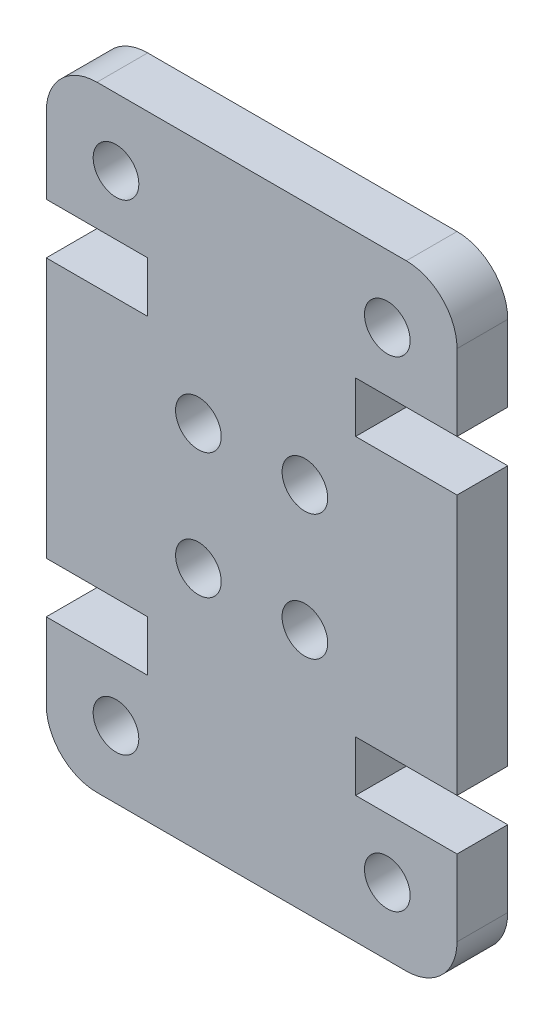
ISO-10303-21;
HEADER;
FILE_DESCRIPTION(('STEP AP214'),'2;1');
FILE_NAME('part.step','',(''),(''),'','','');
FILE_SCHEMA(('AUTOMOTIVE_DESIGN { 1 0 10303 214 1 1 1 1 }'));
ENDSEC;
DATA;
#1=APPLICATION_CONTEXT('core data for automotive mechanical design processes');
#2=APPLICATION_PROTOCOL_DEFINITION('international standard','automotive_design',2000,#1);
#3=PRODUCT_CONTEXT('',#1,'mechanical');
#4=PRODUCT('Part','Part','',(#3));
#5=PRODUCT_RELATED_PRODUCT_CATEGORY('part','',(#4));
#6=PRODUCT_DEFINITION_FORMATION('','',#4);
#7=PRODUCT_DEFINITION_CONTEXT('part definition',#1,'design');
#8=PRODUCT_DEFINITION('design','',#6,#7);
#9=PRODUCT_DEFINITION_SHAPE('','',#8);
#10=(LENGTH_UNIT() NAMED_UNIT(*) SI_UNIT(.MILLI.,.METRE.));
#11=(NAMED_UNIT(*) PLANE_ANGLE_UNIT() SI_UNIT($,.RADIAN.));
#12=(NAMED_UNIT(*) SI_UNIT($,.STERADIAN.) SOLID_ANGLE_UNIT());
#13=UNCERTAINTY_MEASURE_WITH_UNIT(LENGTH_MEASURE(1.E-05),#10,'distance_accuracy_value','');
#14=(GEOMETRIC_REPRESENTATION_CONTEXT(3) GLOBAL_UNCERTAINTY_ASSIGNED_CONTEXT((#13)) GLOBAL_UNIT_ASSIGNED_CONTEXT((#10,
#11,#12)) REPRESENTATION_CONTEXT('',''));
#15=CARTESIAN_POINT('',(0.,0.,0.));
#16=DIRECTION('',(0.,0.,1.));
#17=DIRECTION('',(1.,0.,0.));
#18=AXIS2_PLACEMENT_3D('',#15,#16,#17);
#19=CARTESIAN_POINT('',(14.2,2.,2.));
#20=DIRECTION('',(0.,0.,-1.));
#21=DIRECTION('',(-1.,0.,0.));
#22=AXIS2_PLACEMENT_3D('',#19,#20,#21);
#23=PLANE('',#22);
#24=CARTESIAN_POINT('',(6.00000000000001,9.65355116894447,2.));
#25=DIRECTION('',(0.,0.,1.));
#26=DIRECTION('',(1.,0.,0.));
#27=AXIS2_PLACEMENT_3D('',#24,#25,#26);
#28=CIRCLE('',#27,0.899999999999999);
#29=CARTESIAN_POINT('',(6.9,9.65355116894447,2.));
#30=VERTEX_POINT('',#29);
#31=EDGE_CURVE('E464',#30,#30,#28,.T.);
#32=ORIENTED_EDGE('',*,*,#31,.F.);
#33=EDGE_LOOP('',(#32));
#34=FACE_BOUND('',#33,.T.);
#35=CARTESIAN_POINT('',(10.2,14.6064488310555,2.));
#36=DIRECTION('',(0.,0.,1.));
#37=DIRECTION('',(1.,0.,0.));
#38=AXIS2_PLACEMENT_3D('',#35,#36,#37);
#39=CIRCLE('',#38,0.9);
#40=CARTESIAN_POINT('',(11.1,14.6064488310555,2.));
#41=VERTEX_POINT('',#40);
#42=EDGE_CURVE('E476',#41,#41,#39,.T.);
#43=ORIENTED_EDGE('',*,*,#42,.F.);
#44=EDGE_LOOP('',(#43));
#45=FACE_BOUND('',#44,.T.);
#46=CARTESIAN_POINT('',(2.75000000000003,21.606448831055,2.));
#47=DIRECTION('',(0.,0.,1.));
#48=DIRECTION('',(-1.,0.,0.));
#49=AXIS2_PLACEMENT_3D('',#46,#47,#48);
#50=CIRCLE('',#49,0.9);
#51=CARTESIAN_POINT('',(1.85000000000003,21.606448831055,2.));
#52=VERTEX_POINT('',#51);
#53=EDGE_CURVE('E488',#52,#52,#50,.T.);
#54=ORIENTED_EDGE('',*,*,#53,.F.);
#55=EDGE_LOOP('',(#54));
#56=FACE_BOUND('',#55,.T.);
#57=CARTESIAN_POINT('',(13.45,2.65355116894501,2.));
#58=DIRECTION('',(0.,0.,1.));
#59=DIRECTION('',(-1.,0.,0.));
#60=AXIS2_PLACEMENT_3D('',#57,#58,#59);
#61=CIRCLE('',#60,0.9);
#62=CARTESIAN_POINT('',(12.55,2.65355116894501,2.));
#63=VERTEX_POINT('',#62);
#64=EDGE_CURVE('E230',#63,#63,#61,.T.);
#65=ORIENTED_EDGE('',*,*,#64,.F.);
#66=EDGE_LOOP('',(#65));
#67=FACE_BOUND('',#66,.T.);
#68=CARTESIAN_POINT('',(14.2,2.,2.));
#69=DIRECTION('',(0.,0.,1.));
#70=DIRECTION('',(-1.,0.,0.));
#71=AXIS2_PLACEMENT_3D('',#68,#69,#70);
#72=CIRCLE('',#71,2.);
#73=CARTESIAN_POINT('',(14.2,0.,2.));
#74=VERTEX_POINT('',#73);
#75=CARTESIAN_POINT('',(16.2,2.,2.));
#76=VERTEX_POINT('',#75);
#77=EDGE_CURVE('E273',#74,#76,#72,.T.);
#78=ORIENTED_EDGE('',*,*,#77,.T.);
#79=DIRECTION('',(0.,1.,0.));
#80=VECTOR('',#79,1.);
#81=CARTESIAN_POINT('',(16.2,2.,2.));
#82=LINE('',#81,#80);
#83=CARTESIAN_POINT('',(16.2,4.99999999999945,2.));
#84=VERTEX_POINT('',#83);
#85=EDGE_CURVE('E141',#76,#84,#82,.T.);
#86=ORIENTED_EDGE('',*,*,#85,.T.);
#87=DIRECTION('',(-1.,0.,0.));
#88=VECTOR('',#87,1.);
#89=CARTESIAN_POINT('',(12.2,4.99999999999945,2.));
#90=LINE('',#89,#88);
#91=CARTESIAN_POINT('',(12.2,4.99999999999945,2.));
#92=VERTEX_POINT('',#91);
#93=EDGE_CURVE('E336',#84,#92,#90,.T.);
#94=ORIENTED_EDGE('',*,*,#93,.T.);
#95=DIRECTION('',(0.,1.,0.));
#96=VECTOR('',#95,1.);
#97=CARTESIAN_POINT('',(12.2,6.99999999999945,2.));
#98=LINE('',#97,#96);
#99=CARTESIAN_POINT('',(12.2,6.99999999999945,2.));
#100=VERTEX_POINT('',#99);
#101=EDGE_CURVE('E355',#92,#100,#98,.T.);
#102=ORIENTED_EDGE('',*,*,#101,.T.);
#103=DIRECTION('',(1.,0.,0.));
#104=VECTOR('',#103,1.);
#105=CARTESIAN_POINT('',(16.2,6.99999999999945,2.));
#106=LINE('',#105,#104);
#107=CARTESIAN_POINT('',(16.2,6.99999999999945,2.));
#108=VERTEX_POINT('',#107);
#109=EDGE_CURVE('E352',#100,#108,#106,.T.);
#110=ORIENTED_EDGE('',*,*,#109,.T.);
#111=DIRECTION('',(0.,1.,0.));
#112=VECTOR('',#111,1.);
#113=CARTESIAN_POINT('',(16.2,17.2600000000005,2.));
#114=LINE('',#113,#112);
#115=CARTESIAN_POINT('',(16.2,17.2600000000005,2.));
#116=VERTEX_POINT('',#115);
#117=EDGE_CURVE('E354',#108,#116,#114,.T.);
#118=ORIENTED_EDGE('',*,*,#117,.T.);
#119=DIRECTION('',(-1.,0.,0.));
#120=VECTOR('',#119,1.);
#121=CARTESIAN_POINT('',(16.2,17.2600000000005,2.));
#122=LINE('',#121,#120);
#123=CARTESIAN_POINT('',(12.2,17.2600000000005,2.));
#124=VERTEX_POINT('',#123);
#125=EDGE_CURVE('E357',#116,#124,#122,.T.);
#126=ORIENTED_EDGE('',*,*,#125,.T.);
#127=DIRECTION('',(0.,1.,0.));
#128=VECTOR('',#127,1.);
#129=CARTESIAN_POINT('',(12.2,17.2600000000005,2.));
#130=LINE('',#129,#128);
#131=CARTESIAN_POINT('',(12.2,19.2600000000005,2.));
#132=VERTEX_POINT('',#131);
#133=EDGE_CURVE('E363',#124,#132,#130,.T.);
#134=ORIENTED_EDGE('',*,*,#133,.T.);
#135=DIRECTION('',(1.,0.,0.));
#136=VECTOR('',#135,1.);
#137=CARTESIAN_POINT('',(12.2,19.2600000000005,2.));
#138=LINE('',#137,#136);
#139=CARTESIAN_POINT('',(16.2,19.2600000000005,2.));
#140=VERTEX_POINT('',#139);
#141=EDGE_CURVE('E365',#132,#140,#138,.T.);
#142=ORIENTED_EDGE('',*,*,#141,.T.);
#143=DIRECTION('',(0.,1.,0.));
#144=VECTOR('',#143,1.);
#145=CARTESIAN_POINT('',(16.2,22.26,2.));
#146=LINE('',#145,#144);
#147=CARTESIAN_POINT('',(16.2,22.26,2.));
#148=VERTEX_POINT('',#147);
#149=EDGE_CURVE('E367',#140,#148,#146,.T.);
#150=ORIENTED_EDGE('',*,*,#149,.T.);
#151=CARTESIAN_POINT('',(14.2,22.26,2.));
#152=DIRECTION('',(0.,0.,1.));
#153=DIRECTION('',(1.,0.,0.));
#154=AXIS2_PLACEMENT_3D('',#151,#152,#153);
#155=CIRCLE('',#154,2.);
#156=CARTESIAN_POINT('',(14.2,24.26,2.));
#157=VERTEX_POINT('',#156);
#158=EDGE_CURVE('E369',#148,#157,#155,.T.);
#159=ORIENTED_EDGE('',*,*,#158,.T.);
#160=DIRECTION('',(-1.,0.,0.));
#161=VECTOR('',#160,1.);
#162=CARTESIAN_POINT('',(1.99999999999999,24.26,2.));
#163=LINE('',#162,#161);
#164=CARTESIAN_POINT('',(1.99999999999999,24.26,2.));
#165=VERTEX_POINT('',#164);
#166=EDGE_CURVE('E371',#157,#165,#163,.T.);
#167=ORIENTED_EDGE('',*,*,#166,.T.);
#168=CARTESIAN_POINT('',(2.,22.26,2.));
#169=DIRECTION('',(0.,0.,1.));
#170=DIRECTION('',(-1.,0.,0.));
#171=AXIS2_PLACEMENT_3D('',#168,#169,#170);
#172=CIRCLE('',#171,2.);
#173=CARTESIAN_POINT('',(0.,22.26,2.));
#174=VERTEX_POINT('',#173);
#175=EDGE_CURVE('E373',#165,#174,#172,.T.);
#176=ORIENTED_EDGE('',*,*,#175,.T.);
#177=DIRECTION('',(0.,-1.,0.));
#178=VECTOR('',#177,1.);
#179=CARTESIAN_POINT('',(0.,22.26,2.));
#180=LINE('',#179,#178);
#181=CARTESIAN_POINT('',(0.,19.2600000000005,2.));
#182=VERTEX_POINT('',#181);
#183=EDGE_CURVE('E375',#174,#182,#180,.T.);
#184=ORIENTED_EDGE('',*,*,#183,.T.);
#185=DIRECTION('',(1.,0.,0.));
#186=VECTOR('',#185,1.);
#187=CARTESIAN_POINT('',(3.99999999999999,19.2600000000005,2.));
#188=LINE('',#187,#186);
#189=CARTESIAN_POINT('',(3.99999999999999,19.2600000000005,2.));
#190=VERTEX_POINT('',#189);
#191=EDGE_CURVE('E377',#182,#190,#188,.T.);
#192=ORIENTED_EDGE('',*,*,#191,.T.);
#193=DIRECTION('',(0.,-1.,0.));
#194=VECTOR('',#193,1.);
#195=CARTESIAN_POINT('',(3.99999999999999,17.2600000000005,2.));
#196=LINE('',#195,#194);
#197=CARTESIAN_POINT('',(3.99999999999999,17.2600000000005,2.));
#198=VERTEX_POINT('',#197);
#199=EDGE_CURVE('E379',#190,#198,#196,.T.);
#200=ORIENTED_EDGE('',*,*,#199,.T.);
#201=DIRECTION('',(-1.,0.,0.));
#202=VECTOR('',#201,1.);
#203=CARTESIAN_POINT('',(0.,17.2600000000005,2.));
#204=LINE('',#203,#202);
#205=CARTESIAN_POINT('',(0.,17.2600000000005,2.));
#206=VERTEX_POINT('',#205);
#207=EDGE_CURVE('E381',#198,#206,#204,.T.);
#208=ORIENTED_EDGE('',*,*,#207,.T.);
#209=DIRECTION('',(0.,-1.,0.));
#210=VECTOR('',#209,1.);
#211=CARTESIAN_POINT('',(0.,17.2600000000005,2.));
#212=LINE('',#211,#210);
#213=CARTESIAN_POINT('',(0.,6.99999999999945,2.));
#214=VERTEX_POINT('',#213);
#215=EDGE_CURVE('E383',#206,#214,#212,.T.);
#216=ORIENTED_EDGE('',*,*,#215,.T.);
#217=DIRECTION('',(1.,0.,0.));
#218=VECTOR('',#217,1.);
#219=CARTESIAN_POINT('',(0.,6.99999999999945,2.));
#220=LINE('',#219,#218);
#221=CARTESIAN_POINT('',(4.,6.99999999999945,2.));
#222=VERTEX_POINT('',#221);
#223=EDGE_CURVE('E385',#214,#222,#220,.T.);
#224=ORIENTED_EDGE('',*,*,#223,.T.);
#225=DIRECTION('',(0.,-1.,0.));
#226=VECTOR('',#225,1.);
#227=CARTESIAN_POINT('',(4.,6.99999999999945,2.));
#228=LINE('',#227,#226);
#229=CARTESIAN_POINT('',(4.,4.99999999999945,2.));
#230=VERTEX_POINT('',#229);
#231=EDGE_CURVE('E387',#222,#230,#228,.T.);
#232=ORIENTED_EDGE('',*,*,#231,.T.);
#233=DIRECTION('',(-1.,0.,0.));
#234=VECTOR('',#233,1.);
#235=CARTESIAN_POINT('',(4.,4.99999999999945,2.));
#236=LINE('',#235,#234);
#237=CARTESIAN_POINT('',(0.,4.99999999999945,2.));
#238=VERTEX_POINT('',#237);
#239=EDGE_CURVE('E208',#230,#238,#236,.T.);
#240=ORIENTED_EDGE('',*,*,#239,.T.);
#241=DIRECTION('',(0.,-1.,0.));
#242=VECTOR('',#241,1.);
#243=CARTESIAN_POINT('',(0.,2.,2.));
#244=LINE('',#243,#242);
#245=CARTESIAN_POINT('',(0.,2.,2.));
#246=VERTEX_POINT('',#245);
#247=EDGE_CURVE('E202',#238,#246,#244,.T.);
#248=ORIENTED_EDGE('',*,*,#247,.T.);
#249=CARTESIAN_POINT('',(2.,2.,2.));
#250=DIRECTION('',(0.,0.,1.));
#251=DIRECTION('',(1.,0.,0.));
#252=AXIS2_PLACEMENT_3D('',#249,#250,#251);
#253=CIRCLE('',#252,2.);
#254=CARTESIAN_POINT('',(2.,0.,2.));
#255=VERTEX_POINT('',#254);
#256=EDGE_CURVE('E206',#246,#255,#253,.T.);
#257=ORIENTED_EDGE('',*,*,#256,.T.);
#258=DIRECTION('',(1.,0.,0.));
#259=VECTOR('',#258,1.);
#260=CARTESIAN_POINT('',(2.,0.,2.));
#261=LINE('',#260,#259);
#262=EDGE_CURVE('E50',#255,#74,#261,.T.);
#263=ORIENTED_EDGE('',*,*,#262,.T.);
#264=EDGE_LOOP('',(#78,#86,#94,#102,#110,#118,#126,#134,#142,#150,#159,#167,#176,#184,#192,#200,
#208,#216,#224,#232,#240,#248,#257,#263));
#265=FACE_BOUND('',#264,.T.);
#266=CARTESIAN_POINT('',(10.2,9.65355116894447,2.));
#267=DIRECTION('',(0.,0.,1.));
#268=DIRECTION('',(-1.,0.,0.));
#269=AXIS2_PLACEMENT_3D('',#266,#267,#268);
#270=CIRCLE('',#269,0.9);
#271=CARTESIAN_POINT('',(9.29999999999999,9.65355116894447,2.));
#272=VERTEX_POINT('',#271);
#273=EDGE_CURVE('E494',#272,#272,#270,.T.);
#274=ORIENTED_EDGE('',*,*,#273,.F.);
#275=EDGE_LOOP('',(#274));
#276=FACE_BOUND('',#275,.T.);
#277=CARTESIAN_POINT('',(6.,14.6064488310555,2.));
#278=DIRECTION('',(0.,0.,1.));
#279=DIRECTION('',(-1.,0.,0.));
#280=AXIS2_PLACEMENT_3D('',#277,#278,#279);
#281=CIRCLE('',#280,0.899999999999999);
#282=CARTESIAN_POINT('',(5.1,14.6064488310555,2.));
#283=VERTEX_POINT('',#282);
#284=EDGE_CURVE('E482',#283,#283,#281,.T.);
#285=ORIENTED_EDGE('',*,*,#284,.F.);
#286=EDGE_LOOP('',(#285));
#287=FACE_BOUND('',#286,.T.);
#288=CARTESIAN_POINT('',(13.45,21.606448831055,2.));
#289=DIRECTION('',(0.,0.,1.));
#290=DIRECTION('',(1.,0.,0.));
#291=AXIS2_PLACEMENT_3D('',#288,#289,#290);
#292=CIRCLE('',#291,0.900000000000001);
#293=CARTESIAN_POINT('',(14.35,21.606448831055,2.));
#294=VERTEX_POINT('',#293);
#295=EDGE_CURVE('E470',#294,#294,#292,.T.);
#296=ORIENTED_EDGE('',*,*,#295,.F.);
#297=EDGE_LOOP('',(#296));
#298=FACE_BOUND('',#297,.T.);
#299=CARTESIAN_POINT('',(2.75000000000003,2.65355116894501,2.));
#300=DIRECTION('',(0.,0.,1.));
#301=DIRECTION('',(1.,0.,0.));
#302=AXIS2_PLACEMENT_3D('',#299,#300,#301);
#303=CIRCLE('',#302,0.9);
#304=CARTESIAN_POINT('',(3.65000000000003,2.65355116894501,2.));
#305=VERTEX_POINT('',#304);
#306=EDGE_CURVE('E455',#305,#305,#303,.T.);
#307=ORIENTED_EDGE('',*,*,#306,.F.);
#308=EDGE_LOOP('',(#307));
#309=FACE_BOUND('',#308,.T.);
#310=ADVANCED_FACE('F33',(#34,#45,#56,#67,#265,#276,#287,#298,#309),#23,.F.);
#311=CARTESIAN_POINT('',(14.2,2.,0.));
#312=DIRECTION('',(0.,0.,-1.));
#313=DIRECTION('',(-1.,0.,0.));
#314=AXIS2_PLACEMENT_3D('',#311,#312,#313);
#315=PLANE('',#314);
#316=CARTESIAN_POINT('',(6.00000000000001,9.65355116894447,0.));
#317=DIRECTION('',(0.,0.,1.));
#318=DIRECTION('',(1.,0.,0.));
#319=AXIS2_PLACEMENT_3D('',#316,#317,#318);
#320=CIRCLE('',#319,0.899999999999999);
#321=CARTESIAN_POINT('',(6.9,9.65355116894447,0.));
#322=VERTEX_POINT('',#321);
#323=EDGE_CURVE('E461',#322,#322,#320,.T.);
#324=ORIENTED_EDGE('',*,*,#323,.T.);
#325=EDGE_LOOP('',(#324));
#326=FACE_BOUND('',#325,.T.);
#327=CARTESIAN_POINT('',(10.2,14.6064488310555,0.));
#328=DIRECTION('',(0.,0.,1.));
#329=DIRECTION('',(1.,0.,0.));
#330=AXIS2_PLACEMENT_3D('',#327,#328,#329);
#331=CIRCLE('',#330,0.9);
#332=CARTESIAN_POINT('',(11.1,14.6064488310555,0.));
#333=VERTEX_POINT('',#332);
#334=EDGE_CURVE('E473',#333,#333,#331,.T.);
#335=ORIENTED_EDGE('',*,*,#334,.T.);
#336=EDGE_LOOP('',(#335));
#337=FACE_BOUND('',#336,.T.);
#338=CARTESIAN_POINT('',(2.75000000000003,21.606448831055,0.));
#339=DIRECTION('',(0.,0.,1.));
#340=DIRECTION('',(-1.,0.,0.));
#341=AXIS2_PLACEMENT_3D('',#338,#339,#340);
#342=CIRCLE('',#341,0.9);
#343=CARTESIAN_POINT('',(1.85000000000003,21.606448831055,0.));
#344=VERTEX_POINT('',#343);
#345=EDGE_CURVE('E485',#344,#344,#342,.T.);
#346=ORIENTED_EDGE('',*,*,#345,.T.);
#347=EDGE_LOOP('',(#346));
#348=FACE_BOUND('',#347,.T.);
#349=CARTESIAN_POINT('',(13.45,2.65355116894501,0.));
#350=DIRECTION('',(0.,0.,1.));
#351=DIRECTION('',(-1.,0.,0.));
#352=AXIS2_PLACEMENT_3D('',#349,#350,#351);
#353=CIRCLE('',#352,0.9);
#354=CARTESIAN_POINT('',(12.55,2.65355116894501,0.));
#355=VERTEX_POINT('',#354);
#356=EDGE_CURVE('E497',#355,#355,#353,.T.);
#357=ORIENTED_EDGE('',*,*,#356,.T.);
#358=EDGE_LOOP('',(#357));
#359=FACE_BOUND('',#358,.T.);
#360=CARTESIAN_POINT('',(14.2,2.,0.));
#361=DIRECTION('',(0.,0.,1.));
#362=DIRECTION('',(-1.,0.,0.));
#363=AXIS2_PLACEMENT_3D('',#360,#361,#362);
#364=CIRCLE('',#363,2.);
#365=CARTESIAN_POINT('',(14.2,0.,0.));
#366=VERTEX_POINT('',#365);
#367=CARTESIAN_POINT('',(16.2,2.,0.));
#368=VERTEX_POINT('',#367);
#369=EDGE_CURVE('E226',#366,#368,#364,.T.);
#370=ORIENTED_EDGE('',*,*,#369,.F.);
#371=DIRECTION('',(1.,0.,0.));
#372=VECTOR('',#371,1.);
#373=CARTESIAN_POINT('',(2.,0.,0.));
#374=LINE('',#373,#372);
#375=CARTESIAN_POINT('',(2.,0.,0.));
#376=VERTEX_POINT('',#375);
#377=EDGE_CURVE('E133',#376,#366,#374,.T.);
#378=ORIENTED_EDGE('',*,*,#377,.F.);
#379=CARTESIAN_POINT('',(2.,2.,0.));
#380=DIRECTION('',(0.,0.,1.));
#381=DIRECTION('',(1.,0.,0.));
#382=AXIS2_PLACEMENT_3D('',#379,#380,#381);
#383=CIRCLE('',#382,2.);
#384=CARTESIAN_POINT('',(0.,2.,0.));
#385=VERTEX_POINT('',#384);
#386=EDGE_CURVE('E127',#385,#376,#383,.T.);
#387=ORIENTED_EDGE('',*,*,#386,.F.);
#388=DIRECTION('',(0.,-1.,0.));
#389=VECTOR('',#388,1.);
#390=CARTESIAN_POINT('',(0.,2.,0.));
#391=LINE('',#390,#389);
#392=CARTESIAN_POINT('',(0.,4.99999999999945,0.));
#393=VERTEX_POINT('',#392);
#394=EDGE_CURVE('E216',#393,#385,#391,.T.);
#395=ORIENTED_EDGE('',*,*,#394,.F.);
#396=DIRECTION('',(-1.,0.,0.));
#397=VECTOR('',#396,1.);
#398=CARTESIAN_POINT('',(4.,4.99999999999945,0.));
#399=LINE('',#398,#397);
#400=CARTESIAN_POINT('',(4.,4.99999999999945,0.));
#401=VERTEX_POINT('',#400);
#402=EDGE_CURVE('E268',#401,#393,#399,.T.);
#403=ORIENTED_EDGE('',*,*,#402,.F.);
#404=DIRECTION('',(0.,-1.,0.));
#405=VECTOR('',#404,1.);
#406=CARTESIAN_POINT('',(4.,6.99999999999945,0.));
#407=LINE('',#406,#405);
#408=CARTESIAN_POINT('',(4.,6.99999999999945,0.));
#409=VERTEX_POINT('',#408);
#410=EDGE_CURVE('E266',#409,#401,#407,.T.);
#411=ORIENTED_EDGE('',*,*,#410,.F.);
#412=DIRECTION('',(1.,0.,0.));
#413=VECTOR('',#412,1.);
#414=CARTESIAN_POINT('',(0.,6.99999999999945,0.));
#415=LINE('',#414,#413);
#416=CARTESIAN_POINT('',(0.,6.99999999999945,0.));
#417=VERTEX_POINT('',#416);
#418=EDGE_CURVE('E264',#417,#409,#415,.T.);
#419=ORIENTED_EDGE('',*,*,#418,.F.);
#420=DIRECTION('',(0.,-1.,0.));
#421=VECTOR('',#420,1.);
#422=CARTESIAN_POINT('',(0.,17.2600000000005,0.));
#423=LINE('',#422,#421);
#424=CARTESIAN_POINT('',(0.,17.2600000000005,0.));
#425=VERTEX_POINT('',#424);
#426=EDGE_CURVE('E262',#425,#417,#423,.T.);
#427=ORIENTED_EDGE('',*,*,#426,.F.);
#428=DIRECTION('',(-1.,0.,0.));
#429=VECTOR('',#428,1.);
#430=CARTESIAN_POINT('',(0.,17.2600000000005,0.));
#431=LINE('',#430,#429);
#432=CARTESIAN_POINT('',(3.99999999999999,17.2600000000005,0.));
#433=VERTEX_POINT('',#432);
#434=EDGE_CURVE('E260',#433,#425,#431,.T.);
#435=ORIENTED_EDGE('',*,*,#434,.F.);
#436=DIRECTION('',(0.,-1.,0.));
#437=VECTOR('',#436,1.);
#438=CARTESIAN_POINT('',(3.99999999999999,17.2600000000005,0.));
#439=LINE('',#438,#437);
#440=CARTESIAN_POINT('',(3.99999999999999,19.2600000000005,0.));
#441=VERTEX_POINT('',#440);
#442=EDGE_CURVE('E258',#441,#433,#439,.T.);
#443=ORIENTED_EDGE('',*,*,#442,.F.);
#444=DIRECTION('',(1.,0.,0.));
#445=VECTOR('',#444,1.);
#446=CARTESIAN_POINT('',(3.99999999999999,19.2600000000005,0.));
#447=LINE('',#446,#445);
#448=CARTESIAN_POINT('',(0.,19.2600000000005,0.));
#449=VERTEX_POINT('',#448);
#450=EDGE_CURVE('E256',#449,#441,#447,.T.);
#451=ORIENTED_EDGE('',*,*,#450,.F.);
#452=DIRECTION('',(0.,-1.,0.));
#453=VECTOR('',#452,1.);
#454=CARTESIAN_POINT('',(0.,22.26,0.));
#455=LINE('',#454,#453);
#456=CARTESIAN_POINT('',(0.,22.26,0.));
#457=VERTEX_POINT('',#456);
#458=EDGE_CURVE('E254',#457,#449,#455,.T.);
#459=ORIENTED_EDGE('',*,*,#458,.F.);
#460=CARTESIAN_POINT('',(2.,22.26,0.));
#461=DIRECTION('',(0.,0.,1.));
#462=DIRECTION('',(-1.,0.,0.));
#463=AXIS2_PLACEMENT_3D('',#460,#461,#462);
#464=CIRCLE('',#463,2.);
#465=CARTESIAN_POINT('',(1.99999999999999,24.26,0.));
#466=VERTEX_POINT('',#465);
#467=EDGE_CURVE('E252',#466,#457,#464,.T.);
#468=ORIENTED_EDGE('',*,*,#467,.F.);
#469=DIRECTION('',(-1.,0.,0.));
#470=VECTOR('',#469,1.);
#471=CARTESIAN_POINT('',(1.99999999999999,24.26,0.));
#472=LINE('',#471,#470);
#473=CARTESIAN_POINT('',(14.2,24.26,0.));
#474=VERTEX_POINT('',#473);
#475=EDGE_CURVE('E250',#474,#466,#472,.T.);
#476=ORIENTED_EDGE('',*,*,#475,.F.);
#477=CARTESIAN_POINT('',(14.2,22.26,0.));
#478=DIRECTION('',(0.,0.,1.));
#479=DIRECTION('',(1.,0.,0.));
#480=AXIS2_PLACEMENT_3D('',#477,#478,#479);
#481=CIRCLE('',#480,2.);
#482=CARTESIAN_POINT('',(16.2,22.26,0.));
#483=VERTEX_POINT('',#482);
#484=EDGE_CURVE('E248',#483,#474,#481,.T.);
#485=ORIENTED_EDGE('',*,*,#484,.F.);
#486=DIRECTION('',(0.,1.,0.));
#487=VECTOR('',#486,1.);
#488=CARTESIAN_POINT('',(16.2,22.26,0.));
#489=LINE('',#488,#487);
#490=CARTESIAN_POINT('',(16.2,19.2600000000005,0.));
#491=VERTEX_POINT('',#490);
#492=EDGE_CURVE('E246',#491,#483,#489,.T.);
#493=ORIENTED_EDGE('',*,*,#492,.F.);
#494=DIRECTION('',(1.,0.,0.));
#495=VECTOR('',#494,1.);
#496=CARTESIAN_POINT('',(12.2,19.2600000000005,0.));
#497=LINE('',#496,#495);
#498=CARTESIAN_POINT('',(12.2,19.2600000000005,0.));
#499=VERTEX_POINT('',#498);
#500=EDGE_CURVE('E244',#499,#491,#497,.T.);
#501=ORIENTED_EDGE('',*,*,#500,.F.);
#502=DIRECTION('',(0.,1.,0.));
#503=VECTOR('',#502,1.);
#504=CARTESIAN_POINT('',(12.2,17.2600000000005,0.));
#505=LINE('',#504,#503);
#506=CARTESIAN_POINT('',(12.2,17.2600000000005,0.));
#507=VERTEX_POINT('',#506);
#508=EDGE_CURVE('E242',#507,#499,#505,.T.);
#509=ORIENTED_EDGE('',*,*,#508,.F.);
#510=DIRECTION('',(-1.,0.,0.));
#511=VECTOR('',#510,1.);
#512=CARTESIAN_POINT('',(16.2,17.2600000000005,0.));
#513=LINE('',#512,#511);
#514=CARTESIAN_POINT('',(16.2,17.2600000000005,0.));
#515=VERTEX_POINT('',#514);
#516=EDGE_CURVE('E240',#515,#507,#513,.T.);
#517=ORIENTED_EDGE('',*,*,#516,.F.);
#518=DIRECTION('',(0.,1.,0.));
#519=VECTOR('',#518,1.);
#520=CARTESIAN_POINT('',(16.2,17.2600000000005,0.));
#521=LINE('',#520,#519);
#522=CARTESIAN_POINT('',(16.2,6.99999999999945,0.));
#523=VERTEX_POINT('',#522);
#524=EDGE_CURVE('E238',#523,#515,#521,.T.);
#525=ORIENTED_EDGE('',*,*,#524,.F.);
#526=DIRECTION('',(1.,0.,0.));
#527=VECTOR('',#526,1.);
#528=CARTESIAN_POINT('',(16.2,6.99999999999945,0.));
#529=LINE('',#528,#527);
#530=CARTESIAN_POINT('',(12.2,6.99999999999945,0.));
#531=VERTEX_POINT('',#530);
#532=EDGE_CURVE('E236',#531,#523,#529,.T.);
#533=ORIENTED_EDGE('',*,*,#532,.F.);
#534=DIRECTION('',(0.,1.,0.));
#535=VECTOR('',#534,1.);
#536=CARTESIAN_POINT('',(12.2,6.99999999999945,0.));
#537=LINE('',#536,#535);
#538=CARTESIAN_POINT('',(12.2,4.99999999999945,0.));
#539=VERTEX_POINT('',#538);
#540=EDGE_CURVE('E234',#539,#531,#537,.T.);
#541=ORIENTED_EDGE('',*,*,#540,.F.);
#542=DIRECTION('',(-1.,0.,0.));
#543=VECTOR('',#542,1.);
#544=CARTESIAN_POINT('',(12.2,4.99999999999945,0.));
#545=LINE('',#544,#543);
#546=CARTESIAN_POINT('',(16.2,4.99999999999945,0.));
#547=VERTEX_POINT('',#546);
#548=EDGE_CURVE('E232',#547,#539,#545,.T.);
#549=ORIENTED_EDGE('',*,*,#548,.F.);
#550=DIRECTION('',(0.,1.,0.));
#551=VECTOR('',#550,1.);
#552=CARTESIAN_POINT('',(16.2,2.,0.));
#553=LINE('',#552,#551);
#554=EDGE_CURVE('E229',#368,#547,#553,.T.);
#555=ORIENTED_EDGE('',*,*,#554,.F.);
#556=EDGE_LOOP('',(#370,#378,#387,#395,#403,#411,#419,#427,#435,#443,#451,#459,#468,#476,#485,
#493,#501,#509,#517,#525,#533,#541,#549,#555));
#557=FACE_BOUND('',#556,.T.);
#558=CARTESIAN_POINT('',(10.2,9.65355116894447,0.));
#559=DIRECTION('',(0.,0.,1.));
#560=DIRECTION('',(-1.,0.,0.));
#561=AXIS2_PLACEMENT_3D('',#558,#559,#560);
#562=CIRCLE('',#561,0.9);
#563=CARTESIAN_POINT('',(9.29999999999999,9.65355116894447,0.));
#564=VERTEX_POINT('',#563);
#565=EDGE_CURVE('E491',#564,#564,#562,.T.);
#566=ORIENTED_EDGE('',*,*,#565,.T.);
#567=EDGE_LOOP('',(#566));
#568=FACE_BOUND('',#567,.T.);
#569=CARTESIAN_POINT('',(6.,14.6064488310555,0.));
#570=DIRECTION('',(0.,0.,1.));
#571=DIRECTION('',(-1.,0.,0.));
#572=AXIS2_PLACEMENT_3D('',#569,#570,#571);
#573=CIRCLE('',#572,0.899999999999999);
#574=CARTESIAN_POINT('',(5.1,14.6064488310555,0.));
#575=VERTEX_POINT('',#574);
#576=EDGE_CURVE('E479',#575,#575,#573,.T.);
#577=ORIENTED_EDGE('',*,*,#576,.T.);
#578=EDGE_LOOP('',(#577));
#579=FACE_BOUND('',#578,.T.);
#580=CARTESIAN_POINT('',(13.45,21.606448831055,0.));
#581=DIRECTION('',(0.,0.,1.));
#582=DIRECTION('',(1.,0.,0.));
#583=AXIS2_PLACEMENT_3D('',#580,#581,#582);
#584=CIRCLE('',#583,0.900000000000001);
#585=CARTESIAN_POINT('',(14.35,21.606448831055,0.));
#586=VERTEX_POINT('',#585);
#587=EDGE_CURVE('E467',#586,#586,#584,.T.);
#588=ORIENTED_EDGE('',*,*,#587,.T.);
#589=EDGE_LOOP('',(#588));
#590=FACE_BOUND('',#589,.T.);
#591=CARTESIAN_POINT('',(2.75000000000003,2.65355116894501,0.));
#592=DIRECTION('',(0.,0.,1.));
#593=DIRECTION('',(1.,0.,0.));
#594=AXIS2_PLACEMENT_3D('',#591,#592,#593);
#595=CIRCLE('',#594,0.9);
#596=CARTESIAN_POINT('',(3.65000000000003,2.65355116894501,0.));
#597=VERTEX_POINT('',#596);
#598=EDGE_CURVE('E458',#597,#597,#595,.T.);
#599=ORIENTED_EDGE('',*,*,#598,.T.);
#600=EDGE_LOOP('',(#599));
#601=FACE_BOUND('',#600,.T.);
#602=ADVANCED_FACE('F340',(#326,#337,#348,#359,#557,#568,#579,#590,#601),#315,.T.);
#603=CARTESIAN_POINT('',(14.2,2.,2.));
#604=DIRECTION('',(0.,0.,-1.));
#605=DIRECTION('',(-1.,0.,0.));
#606=AXIS2_PLACEMENT_3D('',#603,#604,#605);
#607=CYLINDRICAL_SURFACE('',#606,2.);
#608=ORIENTED_EDGE('',*,*,#369,.T.);
#609=DIRECTION('',(0.,0.,-1.));
#610=VECTOR('',#609,1.);
#611=CARTESIAN_POINT('',(16.2,2.,2.));
#612=LINE('',#611,#610);
#613=EDGE_CURVE('E11',#76,#368,#612,.T.);
#614=ORIENTED_EDGE('',*,*,#613,.F.);
#615=ORIENTED_EDGE('',*,*,#77,.F.);
#616=DIRECTION('',(0.,0.,-1.));
#617=VECTOR('',#616,1.);
#618=CARTESIAN_POINT('',(14.2,0.,2.));
#619=LINE('',#618,#617);
#620=EDGE_CURVE('E222',#74,#366,#619,.T.);
#621=ORIENTED_EDGE('',*,*,#620,.T.);
#622=EDGE_LOOP('',(#608,#614,#615,#621));
#623=FACE_BOUND('',#622,.T.);
#624=ADVANCED_FACE('F35',(#623),#607,.T.);
#625=CARTESIAN_POINT('',(16.2,2.,2.));
#626=DIRECTION('',(-1.,0.,0.));
#627=DIRECTION('',(0.,0.,1.));
#628=AXIS2_PLACEMENT_3D('',#625,#626,#627);
#629=PLANE('',#628);
#630=ORIENTED_EDGE('',*,*,#554,.T.);
#631=DIRECTION('',(0.,0.,-1.));
#632=VECTOR('',#631,1.);
#633=CARTESIAN_POINT('',(16.2,4.99999999999945,2.));
#634=LINE('',#633,#632);
#635=EDGE_CURVE('E42',#84,#547,#634,.T.);
#636=ORIENTED_EDGE('',*,*,#635,.F.);
#637=ORIENTED_EDGE('',*,*,#85,.F.);
#638=ORIENTED_EDGE('',*,*,#613,.T.);
#639=EDGE_LOOP('',(#630,#636,#637,#638));
#640=FACE_BOUND('',#639,.T.);
#641=ADVANCED_FACE('F762',(#640),#629,.F.);
#642=CARTESIAN_POINT('',(12.2,4.99999999999945,2.));
#643=DIRECTION('',(0.,-1.,0.));
#644=DIRECTION('',(0.,0.,-1.));
#645=AXIS2_PLACEMENT_3D('',#642,#643,#644);
#646=PLANE('',#645);
#647=ORIENTED_EDGE('',*,*,#548,.T.);
#648=DIRECTION('',(0.,0.,-1.));
#649=VECTOR('',#648,1.);
#650=CARTESIAN_POINT('',(12.2,4.99999999999945,2.));
#651=LINE('',#650,#649);
#652=EDGE_CURVE('E328',#92,#539,#651,.T.);
#653=ORIENTED_EDGE('',*,*,#652,.F.);
#654=ORIENTED_EDGE('',*,*,#93,.F.);
#655=ORIENTED_EDGE('',*,*,#635,.T.);
#656=EDGE_LOOP('',(#647,#653,#654,#655));
#657=FACE_BOUND('',#656,.T.);
#658=ADVANCED_FACE('F334',(#657),#646,.F.);
#659=CARTESIAN_POINT('',(12.2,6.99999999999945,2.));
#660=DIRECTION('',(-1.,0.,0.));
#661=DIRECTION('',(0.,0.,1.));
#662=AXIS2_PLACEMENT_3D('',#659,#660,#661);
#663=PLANE('',#662);
#664=ORIENTED_EDGE('',*,*,#540,.T.);
#665=DIRECTION('',(0.,0.,-1.));
#666=VECTOR('',#665,1.);
#667=CARTESIAN_POINT('',(12.2,6.99999999999945,2.));
#668=LINE('',#667,#666);
#669=EDGE_CURVE('E325',#100,#531,#668,.T.);
#670=ORIENTED_EDGE('',*,*,#669,.F.);
#671=ORIENTED_EDGE('',*,*,#101,.F.);
#672=ORIENTED_EDGE('',*,*,#652,.T.);
#673=EDGE_LOOP('',(#664,#670,#671,#672));
#674=FACE_BOUND('',#673,.T.);
#675=ADVANCED_FACE('F346',(#674),#663,.F.);
#676=CARTESIAN_POINT('',(16.2,6.99999999999945,2.));
#677=DIRECTION('',(0.,1.,0.));
#678=DIRECTION('',(-1.,0.,0.));
#679=AXIS2_PLACEMENT_3D('',#676,#677,#678);
#680=PLANE('',#679);
#681=ORIENTED_EDGE('',*,*,#532,.T.);
#682=DIRECTION('',(0.,0.,-1.));
#683=VECTOR('',#682,1.);
#684=CARTESIAN_POINT('',(16.2,6.99999999999945,2.));
#685=LINE('',#684,#683);
#686=EDGE_CURVE('E322',#108,#523,#685,.T.);
#687=ORIENTED_EDGE('',*,*,#686,.F.);
#688=ORIENTED_EDGE('',*,*,#109,.F.);
#689=ORIENTED_EDGE('',*,*,#669,.T.);
#690=EDGE_LOOP('',(#681,#687,#688,#689));
#691=FACE_BOUND('',#690,.T.);
#692=ADVANCED_FACE('F350',(#691),#680,.F.);
#693=CARTESIAN_POINT('',(16.2,17.2600000000005,2.));
#694=DIRECTION('',(-1.,0.,0.));
#695=DIRECTION('',(0.,0.,1.));
#696=AXIS2_PLACEMENT_3D('',#693,#694,#695);
#697=PLANE('',#696);
#698=ORIENTED_EDGE('',*,*,#524,.T.);
#699=DIRECTION('',(0.,0.,-1.));
#700=VECTOR('',#699,1.);
#701=CARTESIAN_POINT('',(16.2,17.2600000000005,2.));
#702=LINE('',#701,#700);
#703=EDGE_CURVE('E319',#116,#515,#702,.T.);
#704=ORIENTED_EDGE('',*,*,#703,.F.);
#705=ORIENTED_EDGE('',*,*,#117,.F.);
#706=ORIENTED_EDGE('',*,*,#686,.T.);
#707=EDGE_LOOP('',(#698,#704,#705,#706));
#708=FACE_BOUND('',#707,.T.);
#709=ADVANCED_FACE('F727',(#708),#697,.F.);
#710=CARTESIAN_POINT('',(16.2,17.2600000000005,2.));
#711=DIRECTION('',(0.,-1.,0.));
#712=DIRECTION('',(0.,0.,-1.));
#713=AXIS2_PLACEMENT_3D('',#710,#711,#712);
#714=PLANE('',#713);
#715=ORIENTED_EDGE('',*,*,#516,.T.);
#716=DIRECTION('',(0.,0.,-1.));
#717=VECTOR('',#716,1.);
#718=CARTESIAN_POINT('',(12.2,17.2600000000005,2.));
#719=LINE('',#718,#717);
#720=EDGE_CURVE('E316',#124,#507,#719,.T.);
#721=ORIENTED_EDGE('',*,*,#720,.F.);
#722=ORIENTED_EDGE('',*,*,#125,.F.);
#723=ORIENTED_EDGE('',*,*,#703,.T.);
#724=EDGE_LOOP('',(#715,#721,#722,#723));
#725=FACE_BOUND('',#724,.T.);
#726=ADVANCED_FACE('F717',(#725),#714,.F.);
#727=CARTESIAN_POINT('',(12.2,17.2600000000005,2.));
#728=DIRECTION('',(-1.,0.,0.));
#729=DIRECTION('',(0.,0.,1.));
#730=AXIS2_PLACEMENT_3D('',#727,#728,#729);
#731=PLANE('',#730);
#732=ORIENTED_EDGE('',*,*,#508,.T.);
#733=DIRECTION('',(0.,0.,-1.));
#734=VECTOR('',#733,1.);
#735=CARTESIAN_POINT('',(12.2,19.2600000000005,2.));
#736=LINE('',#735,#734);
#737=EDGE_CURVE('E313',#132,#499,#736,.T.);
#738=ORIENTED_EDGE('',*,*,#737,.F.);
#739=ORIENTED_EDGE('',*,*,#133,.F.);
#740=ORIENTED_EDGE('',*,*,#720,.T.);
#741=EDGE_LOOP('',(#732,#738,#739,#740));
#742=FACE_BOUND('',#741,.T.);
#743=ADVANCED_FACE('F707',(#742),#731,.F.);
#744=CARTESIAN_POINT('',(12.2,19.2600000000005,2.));
#745=DIRECTION('',(0.,1.,0.));
#746=DIRECTION('',(0.,0.,1.));
#747=AXIS2_PLACEMENT_3D('',#744,#745,#746);
#748=PLANE('',#747);
#749=ORIENTED_EDGE('',*,*,#500,.T.);
#750=DIRECTION('',(0.,0.,-1.));
#751=VECTOR('',#750,1.);
#752=CARTESIAN_POINT('',(16.2,19.2600000000005,2.));
#753=LINE('',#752,#751);
#754=EDGE_CURVE('E310',#140,#491,#753,.T.);
#755=ORIENTED_EDGE('',*,*,#754,.F.);
#756=ORIENTED_EDGE('',*,*,#141,.F.);
#757=ORIENTED_EDGE('',*,*,#737,.T.);
#758=EDGE_LOOP('',(#749,#755,#756,#757));
#759=FACE_BOUND('',#758,.T.);
#760=ADVANCED_FACE('F697',(#759),#748,.F.);
#761=CARTESIAN_POINT('',(16.2,22.26,2.));
#762=DIRECTION('',(-1.,0.,0.));
#763=DIRECTION('',(0.,0.,1.));
#764=AXIS2_PLACEMENT_3D('',#761,#762,#763);
#765=PLANE('',#764);
#766=ORIENTED_EDGE('',*,*,#492,.T.);
#767=DIRECTION('',(0.,0.,-1.));
#768=VECTOR('',#767,1.);
#769=CARTESIAN_POINT('',(16.2,22.26,2.));
#770=LINE('',#769,#768);
#771=EDGE_CURVE('E307',#148,#483,#770,.T.);
#772=ORIENTED_EDGE('',*,*,#771,.F.);
#773=ORIENTED_EDGE('',*,*,#149,.F.);
#774=ORIENTED_EDGE('',*,*,#754,.T.);
#775=EDGE_LOOP('',(#766,#772,#773,#774));
#776=FACE_BOUND('',#775,.T.);
#777=ADVANCED_FACE('F687',(#776),#765,.F.);
#778=CARTESIAN_POINT('',(14.2,22.26,2.));
#779=DIRECTION('',(0.,0.,-1.));
#780=DIRECTION('',(-1.,0.,0.));
#781=AXIS2_PLACEMENT_3D('',#778,#779,#780);
#782=CYLINDRICAL_SURFACE('',#781,2.);
#783=ORIENTED_EDGE('',*,*,#484,.T.);
#784=DIRECTION('',(0.,0.,-1.));
#785=VECTOR('',#784,1.);
#786=CARTESIAN_POINT('',(14.2,24.26,2.));
#787=LINE('',#786,#785);
#788=EDGE_CURVE('E304',#157,#474,#787,.T.);
#789=ORIENTED_EDGE('',*,*,#788,.F.);
#790=ORIENTED_EDGE('',*,*,#158,.F.);
#791=ORIENTED_EDGE('',*,*,#771,.T.);
#792=EDGE_LOOP('',(#783,#789,#790,#791));
#793=FACE_BOUND('',#792,.T.);
#794=ADVANCED_FACE('F677',(#793),#782,.T.);
#795=CARTESIAN_POINT('',(1.99999999999999,24.26,2.));
#796=DIRECTION('',(0.,-1.,0.));
#797=DIRECTION('',(0.,0.,-1.));
#798=AXIS2_PLACEMENT_3D('',#795,#796,#797);
#799=PLANE('',#798);
#800=ORIENTED_EDGE('',*,*,#475,.T.);
#801=DIRECTION('',(0.,0.,-1.));
#802=VECTOR('',#801,1.);
#803=CARTESIAN_POINT('',(1.99999999999999,24.26,2.));
#804=LINE('',#803,#802);
#805=EDGE_CURVE('E301',#165,#466,#804,.T.);
#806=ORIENTED_EDGE('',*,*,#805,.F.);
#807=ORIENTED_EDGE('',*,*,#166,.F.);
#808=ORIENTED_EDGE('',*,*,#788,.T.);
#809=EDGE_LOOP('',(#800,#806,#807,#808));
#810=FACE_BOUND('',#809,.T.);
#811=ADVANCED_FACE('F667',(#810),#799,.F.);
#812=CARTESIAN_POINT('',(2.,22.26,2.));
#813=DIRECTION('',(0.,0.,-1.));
#814=DIRECTION('',(-1.,0.,0.));
#815=AXIS2_PLACEMENT_3D('',#812,#813,#814);
#816=CYLINDRICAL_SURFACE('',#815,2.);
#817=ORIENTED_EDGE('',*,*,#467,.T.);
#818=DIRECTION('',(0.,0.,-1.));
#819=VECTOR('',#818,1.);
#820=CARTESIAN_POINT('',(0.,22.26,2.));
#821=LINE('',#820,#819);
#822=EDGE_CURVE('E298',#174,#457,#821,.T.);
#823=ORIENTED_EDGE('',*,*,#822,.F.);
#824=ORIENTED_EDGE('',*,*,#175,.F.);
#825=ORIENTED_EDGE('',*,*,#805,.T.);
#826=EDGE_LOOP('',(#817,#823,#824,#825));
#827=FACE_BOUND('',#826,.T.);
#828=ADVANCED_FACE('F657',(#827),#816,.T.);
#829=CARTESIAN_POINT('',(0.,22.26,2.));
#830=DIRECTION('',(1.,0.,0.));
#831=DIRECTION('',(0.,1.,0.));
#832=AXIS2_PLACEMENT_3D('',#829,#830,#831);
#833=PLANE('',#832);
#834=ORIENTED_EDGE('',*,*,#458,.T.);
#835=DIRECTION('',(0.,0.,-1.));
#836=VECTOR('',#835,1.);
#837=CARTESIAN_POINT('',(0.,19.2600000000005,2.));
#838=LINE('',#837,#836);
#839=EDGE_CURVE('E295',#182,#449,#838,.T.);
#840=ORIENTED_EDGE('',*,*,#839,.F.);
#841=ORIENTED_EDGE('',*,*,#183,.F.);
#842=ORIENTED_EDGE('',*,*,#822,.T.);
#843=EDGE_LOOP('',(#834,#840,#841,#842));
#844=FACE_BOUND('',#843,.T.);
#845=ADVANCED_FACE('F647',(#844),#833,.F.);
#846=CARTESIAN_POINT('',(3.99999999999999,19.2600000000005,2.));
#847=DIRECTION('',(0.,1.,0.));
#848=DIRECTION('',(-1.,0.,0.));
#849=AXIS2_PLACEMENT_3D('',#846,#847,#848);
#850=PLANE('',#849);
#851=ORIENTED_EDGE('',*,*,#450,.T.);
#852=DIRECTION('',(0.,0.,-1.));
#853=VECTOR('',#852,1.);
#854=CARTESIAN_POINT('',(3.99999999999999,19.2600000000005,2.));
#855=LINE('',#854,#853);
#856=EDGE_CURVE('E292',#190,#441,#855,.T.);
#857=ORIENTED_EDGE('',*,*,#856,.F.);
#858=ORIENTED_EDGE('',*,*,#191,.F.);
#859=ORIENTED_EDGE('',*,*,#839,.T.);
#860=EDGE_LOOP('',(#851,#857,#858,#859));
#861=FACE_BOUND('',#860,.T.);
#862=ADVANCED_FACE('F637',(#861),#850,.F.);
#863=CARTESIAN_POINT('',(3.99999999999999,17.2600000000005,2.));
#864=DIRECTION('',(1.,0.,0.));
#865=DIRECTION('',(0.,0.,-1.));
#866=AXIS2_PLACEMENT_3D('',#863,#864,#865);
#867=PLANE('',#866);
#868=ORIENTED_EDGE('',*,*,#442,.T.);
#869=DIRECTION('',(0.,0.,-1.));
#870=VECTOR('',#869,1.);
#871=CARTESIAN_POINT('',(3.99999999999999,17.2600000000005,2.));
#872=LINE('',#871,#870);
#873=EDGE_CURVE('E289',#198,#433,#872,.T.);
#874=ORIENTED_EDGE('',*,*,#873,.F.);
#875=ORIENTED_EDGE('',*,*,#199,.F.);
#876=ORIENTED_EDGE('',*,*,#856,.T.);
#877=EDGE_LOOP('',(#868,#874,#875,#876));
#878=FACE_BOUND('',#877,.T.);
#879=ADVANCED_FACE('F627',(#878),#867,.F.);
#880=CARTESIAN_POINT('',(0.,17.2600000000005,2.));
#881=DIRECTION('',(0.,-1.,0.));
#882=DIRECTION('',(1.,0.,0.));
#883=AXIS2_PLACEMENT_3D('',#880,#881,#882);
#884=PLANE('',#883);
#885=ORIENTED_EDGE('',*,*,#434,.T.);
#886=DIRECTION('',(0.,0.,-1.));
#887=VECTOR('',#886,1.);
#888=CARTESIAN_POINT('',(0.,17.2600000000005,2.));
#889=LINE('',#888,#887);
#890=EDGE_CURVE('E286',#206,#425,#889,.T.);
#891=ORIENTED_EDGE('',*,*,#890,.F.);
#892=ORIENTED_EDGE('',*,*,#207,.F.);
#893=ORIENTED_EDGE('',*,*,#873,.T.);
#894=EDGE_LOOP('',(#885,#891,#892,#893));
#895=FACE_BOUND('',#894,.T.);
#896=ADVANCED_FACE('F617',(#895),#884,.F.);
#897=CARTESIAN_POINT('',(0.,17.2600000000005,2.));
#898=DIRECTION('',(1.,0.,0.));
#899=DIRECTION('',(0.,1.,0.));
#900=AXIS2_PLACEMENT_3D('',#897,#898,#899);
#901=PLANE('',#900);
#902=ORIENTED_EDGE('',*,*,#426,.T.);
#903=DIRECTION('',(0.,0.,-1.));
#904=VECTOR('',#903,1.);
#905=CARTESIAN_POINT('',(0.,6.99999999999945,2.));
#906=LINE('',#905,#904);
#907=EDGE_CURVE('E283',#214,#417,#906,.T.);
#908=ORIENTED_EDGE('',*,*,#907,.F.);
#909=ORIENTED_EDGE('',*,*,#215,.F.);
#910=ORIENTED_EDGE('',*,*,#890,.T.);
#911=EDGE_LOOP('',(#902,#908,#909,#910));
#912=FACE_BOUND('',#911,.T.);
#913=ADVANCED_FACE('F607',(#912),#901,.F.);
#914=CARTESIAN_POINT('',(0.,6.99999999999945,2.));
#915=DIRECTION('',(0.,1.,0.));
#916=DIRECTION('',(0.,0.,1.));
#917=AXIS2_PLACEMENT_3D('',#914,#915,#916);
#918=PLANE('',#917);
#919=ORIENTED_EDGE('',*,*,#418,.T.);
#920=DIRECTION('',(0.,0.,-1.));
#921=VECTOR('',#920,1.);
#922=CARTESIAN_POINT('',(4.,6.99999999999945,2.));
#923=LINE('',#922,#921);
#924=EDGE_CURVE('E280',#222,#409,#923,.T.);
#925=ORIENTED_EDGE('',*,*,#924,.F.);
#926=ORIENTED_EDGE('',*,*,#223,.F.);
#927=ORIENTED_EDGE('',*,*,#907,.T.);
#928=EDGE_LOOP('',(#919,#925,#926,#927));
#929=FACE_BOUND('',#928,.T.);
#930=ADVANCED_FACE('F598',(#929),#918,.F.);
#931=CARTESIAN_POINT('',(4.,6.99999999999945,2.));
#932=DIRECTION('',(1.,0.,0.));
#933=DIRECTION('',(0.,0.,-1.));
#934=AXIS2_PLACEMENT_3D('',#931,#932,#933);
#935=PLANE('',#934);
#936=ORIENTED_EDGE('',*,*,#410,.T.);
#937=DIRECTION('',(0.,0.,-1.));
#938=VECTOR('',#937,1.);
#939=CARTESIAN_POINT('',(4.,4.99999999999945,2.));
#940=LINE('',#939,#938);
#941=EDGE_CURVE('E277',#230,#401,#940,.T.);
#942=ORIENTED_EDGE('',*,*,#941,.F.);
#943=ORIENTED_EDGE('',*,*,#231,.F.);
#944=ORIENTED_EDGE('',*,*,#924,.T.);
#945=EDGE_LOOP('',(#936,#942,#943,#944));
#946=FACE_BOUND('',#945,.T.);
#947=ADVANCED_FACE('F393',(#946),#935,.F.);
#948=CARTESIAN_POINT('',(4.,4.99999999999945,2.));
#949=DIRECTION('',(0.,-1.,0.));
#950=DIRECTION('',(0.,0.,-1.));
#951=AXIS2_PLACEMENT_3D('',#948,#949,#950);
#952=PLANE('',#951);
#953=ORIENTED_EDGE('',*,*,#402,.T.);
#954=DIRECTION('',(0.,0.,-1.));
#955=VECTOR('',#954,1.);
#956=CARTESIAN_POINT('',(0.,4.99999999999945,2.));
#957=LINE('',#956,#955);
#958=EDGE_CURVE('E217',#238,#393,#957,.T.);
#959=ORIENTED_EDGE('',*,*,#958,.F.);
#960=ORIENTED_EDGE('',*,*,#239,.F.);
#961=ORIENTED_EDGE('',*,*,#941,.T.);
#962=EDGE_LOOP('',(#953,#959,#960,#961));
#963=FACE_BOUND('',#962,.T.);
#964=ADVANCED_FACE('F397',(#963),#952,.F.);
#965=CARTESIAN_POINT('',(0.,2.,2.));
#966=DIRECTION('',(1.,0.,0.));
#967=DIRECTION('',(0.,0.,-1.));
#968=AXIS2_PLACEMENT_3D('',#965,#966,#967);
#969=PLANE('',#968);
#970=ORIENTED_EDGE('',*,*,#394,.T.);
#971=DIRECTION('',(0.,0.,-1.));
#972=VECTOR('',#971,1.);
#973=CARTESIAN_POINT('',(0.,2.,2.));
#974=LINE('',#973,#972);
#975=EDGE_CURVE('E213',#246,#385,#974,.T.);
#976=ORIENTED_EDGE('',*,*,#975,.F.);
#977=ORIENTED_EDGE('',*,*,#247,.F.);
#978=ORIENTED_EDGE('',*,*,#958,.T.);
#979=EDGE_LOOP('',(#970,#976,#977,#978));
#980=FACE_BOUND('',#979,.T.);
#981=ADVANCED_FACE('F214',(#980),#969,.F.);
#982=CARTESIAN_POINT('',(2.,2.,2.));
#983=DIRECTION('',(0.,0.,-1.));
#984=DIRECTION('',(-1.,0.,0.));
#985=AXIS2_PLACEMENT_3D('',#982,#983,#984);
#986=CYLINDRICAL_SURFACE('',#985,2.);
#987=ORIENTED_EDGE('',*,*,#386,.T.);
#988=DIRECTION('',(0.,0.,-1.));
#989=VECTOR('',#988,1.);
#990=CARTESIAN_POINT('',(2.,0.,2.));
#991=LINE('',#990,#989);
#992=EDGE_CURVE('E218',#255,#376,#991,.T.);
#993=ORIENTED_EDGE('',*,*,#992,.F.);
#994=ORIENTED_EDGE('',*,*,#256,.F.);
#995=ORIENTED_EDGE('',*,*,#975,.T.);
#996=EDGE_LOOP('',(#987,#993,#994,#995));
#997=FACE_BOUND('',#996,.T.);
#998=ADVANCED_FACE('F220',(#997),#986,.T.);
#999=CARTESIAN_POINT('',(2.,0.,2.));
#1000=DIRECTION('',(0.,1.,0.));
#1001=DIRECTION('',(-1.,0.,0.));
#1002=AXIS2_PLACEMENT_3D('',#999,#1000,#1001);
#1003=PLANE('',#1002);
#1004=ORIENTED_EDGE('',*,*,#377,.T.);
#1005=ORIENTED_EDGE('',*,*,#620,.F.);
#1006=ORIENTED_EDGE('',*,*,#262,.F.);
#1007=ORIENTED_EDGE('',*,*,#992,.T.);
#1008=EDGE_LOOP('',(#1004,#1005,#1006,#1007));
#1009=FACE_BOUND('',#1008,.T.);
#1010=ADVANCED_FACE('F401',(#1009),#1003,.F.);
#1011=CARTESIAN_POINT('',(13.45,2.65355116894501,2.));
#1012=DIRECTION('',(0.,0.,-1.));
#1013=DIRECTION('',(-1.,0.,0.));
#1014=AXIS2_PLACEMENT_3D('',#1011,#1012,#1013);
#1015=CYLINDRICAL_SURFACE('',#1014,0.9);
#1016=ORIENTED_EDGE('',*,*,#64,.T.);
#1017=EDGE_LOOP('',(#1016));
#1018=FACE_BOUND('',#1017,.T.);
#1019=ORIENTED_EDGE('',*,*,#356,.F.);
#1020=EDGE_LOOP('',(#1019));
#1021=FACE_BOUND('',#1020,.T.);
#1022=ADVANCED_FACE('F403',(#1018,#1021),#1015,.F.);
#1023=CARTESIAN_POINT('',(10.2,9.65355116894447,2.));
#1024=DIRECTION('',(0.,0.,-1.));
#1025=DIRECTION('',(-1.,0.,0.));
#1026=AXIS2_PLACEMENT_3D('',#1023,#1024,#1025);
#1027=CYLINDRICAL_SURFACE('',#1026,0.9);
#1028=ORIENTED_EDGE('',*,*,#273,.T.);
#1029=EDGE_LOOP('',(#1028));
#1030=FACE_BOUND('',#1029,.T.);
#1031=ORIENTED_EDGE('',*,*,#565,.F.);
#1032=EDGE_LOOP('',(#1031));
#1033=FACE_BOUND('',#1032,.T.);
#1034=ADVANCED_FACE('F409',(#1030,#1033),#1027,.F.);
#1035=CARTESIAN_POINT('',(2.75000000000003,21.606448831055,2.));
#1036=DIRECTION('',(0.,0.,-1.));
#1037=DIRECTION('',(-1.,0.,0.));
#1038=AXIS2_PLACEMENT_3D('',#1035,#1036,#1037);
#1039=CYLINDRICAL_SURFACE('',#1038,0.9);
#1040=ORIENTED_EDGE('',*,*,#53,.T.);
#1041=EDGE_LOOP('',(#1040));
#1042=FACE_BOUND('',#1041,.T.);
#1043=ORIENTED_EDGE('',*,*,#345,.F.);
#1044=EDGE_LOOP('',(#1043));
#1045=FACE_BOUND('',#1044,.T.);
#1046=ADVANCED_FACE('F426',(#1042,#1045),#1039,.F.);
#1047=CARTESIAN_POINT('',(6.,14.6064488310555,2.));
#1048=DIRECTION('',(0.,0.,-1.));
#1049=DIRECTION('',(-1.,0.,0.));
#1050=AXIS2_PLACEMENT_3D('',#1047,#1048,#1049);
#1051=CYLINDRICAL_SURFACE('',#1050,0.899999999999999);
#1052=ORIENTED_EDGE('',*,*,#284,.T.);
#1053=EDGE_LOOP('',(#1052));
#1054=FACE_BOUND('',#1053,.T.);
#1055=ORIENTED_EDGE('',*,*,#576,.F.);
#1056=EDGE_LOOP('',(#1055));
#1057=FACE_BOUND('',#1056,.T.);
#1058=ADVANCED_FACE('F430',(#1054,#1057),#1051,.F.);
#1059=CARTESIAN_POINT('',(10.2,14.6064488310555,2.));
#1060=DIRECTION('',(0.,0.,-1.));
#1061=DIRECTION('',(-1.,0.,0.));
#1062=AXIS2_PLACEMENT_3D('',#1059,#1060,#1061);
#1063=CYLINDRICAL_SURFACE('',#1062,0.9);
#1064=ORIENTED_EDGE('',*,*,#42,.T.);
#1065=EDGE_LOOP('',(#1064));
#1066=FACE_BOUND('',#1065,.T.);
#1067=ORIENTED_EDGE('',*,*,#334,.F.);
#1068=EDGE_LOOP('',(#1067));
#1069=FACE_BOUND('',#1068,.T.);
#1070=ADVANCED_FACE('F434',(#1066,#1069),#1063,.F.);
#1071=CARTESIAN_POINT('',(13.45,21.606448831055,2.));
#1072=DIRECTION('',(0.,0.,-1.));
#1073=DIRECTION('',(-1.,0.,0.));
#1074=AXIS2_PLACEMENT_3D('',#1071,#1072,#1073);
#1075=CYLINDRICAL_SURFACE('',#1074,0.900000000000001);
#1076=ORIENTED_EDGE('',*,*,#295,.T.);
#1077=EDGE_LOOP('',(#1076));
#1078=FACE_BOUND('',#1077,.T.);
#1079=ORIENTED_EDGE('',*,*,#587,.F.);
#1080=EDGE_LOOP('',(#1079));
#1081=FACE_BOUND('',#1080,.T.);
#1082=ADVANCED_FACE('F438',(#1078,#1081),#1075,.F.);
#1083=CARTESIAN_POINT('',(6.00000000000001,9.65355116894447,2.));
#1084=DIRECTION('',(0.,0.,-1.));
#1085=DIRECTION('',(-1.,0.,0.));
#1086=AXIS2_PLACEMENT_3D('',#1083,#1084,#1085);
#1087=CYLINDRICAL_SURFACE('',#1086,0.899999999999999);
#1088=ORIENTED_EDGE('',*,*,#31,.T.);
#1089=EDGE_LOOP('',(#1088));
#1090=FACE_BOUND('',#1089,.T.);
#1091=ORIENTED_EDGE('',*,*,#323,.F.);
#1092=EDGE_LOOP('',(#1091));
#1093=FACE_BOUND('',#1092,.T.);
#1094=ADVANCED_FACE('F442',(#1090,#1093),#1087,.F.);
#1095=CARTESIAN_POINT('',(2.75000000000003,2.65355116894501,2.));
#1096=DIRECTION('',(0.,0.,-1.));
#1097=DIRECTION('',(-1.,0.,0.));
#1098=AXIS2_PLACEMENT_3D('',#1095,#1096,#1097);
#1099=CYLINDRICAL_SURFACE('',#1098,0.9);
#1100=ORIENTED_EDGE('',*,*,#306,.T.);
#1101=EDGE_LOOP('',(#1100));
#1102=FACE_BOUND('',#1101,.T.);
#1103=ORIENTED_EDGE('',*,*,#598,.F.);
#1104=EDGE_LOOP('',(#1103));
#1105=FACE_BOUND('',#1104,.T.);
#1106=ADVANCED_FACE('F446',(#1102,#1105),#1099,.F.);
#1107=CLOSED_SHELL('',(#310,#602,#624,#641,#658,#675,#692,#709,#726,#743,#760,#777,#794,#811,
#828,#845,#862,#879,#896,#913,#930,#947,#964,#981,#998,#1010,#1022,#1034,#1046,#1058,#1070,
#1082,#1094,#1106));
#1108=MANIFOLD_SOLID_BREP('B2',#1107);
#1109=ADVANCED_BREP_SHAPE_REPRESENTATION('',(#18,#1108),#14);
#1110=SHAPE_DEFINITION_REPRESENTATION(#9,#1109);
ENDSEC;
END-ISO-10303-21;
